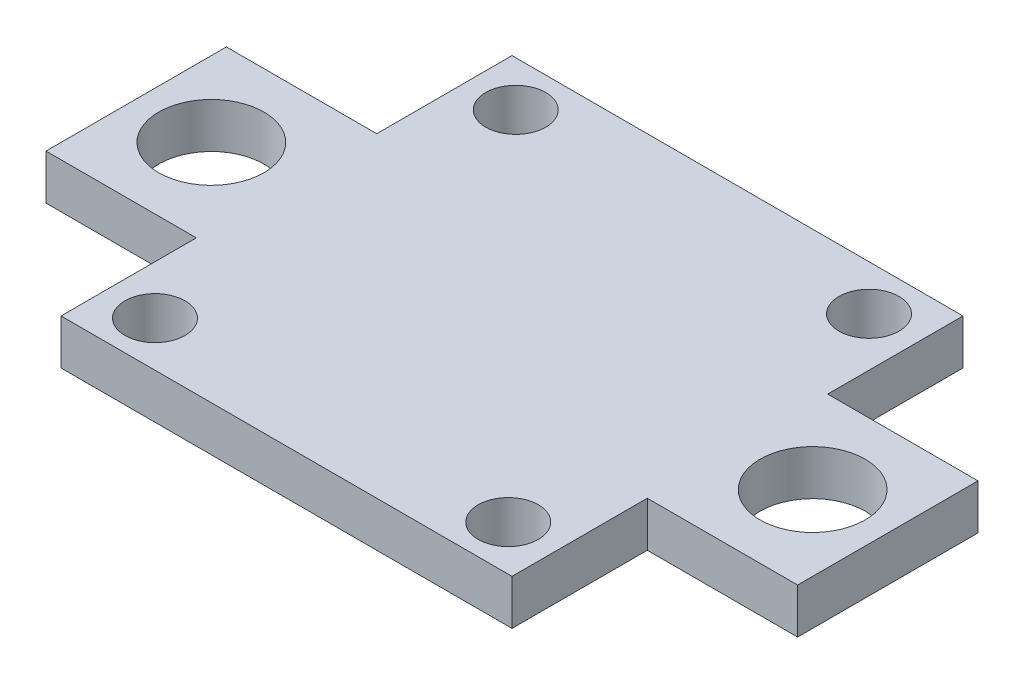
ISO-10303-21;
HEADER;
FILE_DESCRIPTION(('STEP AP214'),'2;1');
FILE_NAME('part.step','',(''),(''),'','','');
FILE_SCHEMA(('AUTOMOTIVE_DESIGN { 1 0 10303 214 1 1 1 1 }'));
ENDSEC;
DATA;
#1=APPLICATION_CONTEXT('core data for automotive mechanical design processes');
#2=APPLICATION_PROTOCOL_DEFINITION('international standard','automotive_design',2000,#1);
#3=PRODUCT_CONTEXT('',#1,'mechanical');
#4=PRODUCT('Part','Part','',(#3));
#5=PRODUCT_RELATED_PRODUCT_CATEGORY('part','',(#4));
#6=PRODUCT_DEFINITION_FORMATION('','',#4);
#7=PRODUCT_DEFINITION_CONTEXT('part definition',#1,'design');
#8=PRODUCT_DEFINITION('design','',#6,#7);
#9=PRODUCT_DEFINITION_SHAPE('','',#8);
#10=(LENGTH_UNIT() NAMED_UNIT(*) SI_UNIT(.MILLI.,.METRE.));
#11=(NAMED_UNIT(*) PLANE_ANGLE_UNIT() SI_UNIT($,.RADIAN.));
#12=(NAMED_UNIT(*) SI_UNIT($,.STERADIAN.) SOLID_ANGLE_UNIT());
#13=UNCERTAINTY_MEASURE_WITH_UNIT(LENGTH_MEASURE(1.E-05),#10,'distance_accuracy_value','');
#14=(GEOMETRIC_REPRESENTATION_CONTEXT(3) GLOBAL_UNCERTAINTY_ASSIGNED_CONTEXT((#13)) GLOBAL_UNIT_ASSIGNED_CONTEXT((#10,
#11,#12)) REPRESENTATION_CONTEXT('',''));
#15=CARTESIAN_POINT('',(0.,0.,0.));
#16=DIRECTION('',(0.,0.,1.));
#17=DIRECTION('',(1.,0.,0.));
#18=AXIS2_PLACEMENT_3D('',#15,#16,#17);
#19=CARTESIAN_POINT('',(-15.,3.,-15.));
#20=DIRECTION('',(1.,0.,0.));
#21=DIRECTION('',(0.,0.,-1.));
#22=AXIS2_PLACEMENT_3D('',#19,#20,#21);
#23=PLANE('',#22);
#24=DIRECTION('',(0.,0.,1.));
#25=VECTOR('',#24,1.);
#26=CARTESIAN_POINT('',(-15.,0.,-15.));
#27=LINE('',#26,#25);
#28=CARTESIAN_POINT('',(-15.,0.,-15.));
#29=VERTEX_POINT('',#28);
#30=CARTESIAN_POINT('',(-15.,0.,-6.));
#31=VERTEX_POINT('',#30);
#32=EDGE_CURVE('E170',#29,#31,#27,.T.);
#33=ORIENTED_EDGE('',*,*,#32,.T.);
#34=DIRECTION('',(0.,-1.,0.));
#35=VECTOR('',#34,1.);
#36=CARTESIAN_POINT('',(-15.,3.,-6.));
#37=LINE('',#36,#35);
#38=CARTESIAN_POINT('',(-15.,3.,-6.));
#39=VERTEX_POINT('',#38);
#40=EDGE_CURVE('E11',#39,#31,#37,.T.);
#41=ORIENTED_EDGE('',*,*,#40,.F.);
#42=DIRECTION('',(0.,0.,1.));
#43=VECTOR('',#42,1.);
#44=CARTESIAN_POINT('',(-15.,3.,-15.));
#45=LINE('',#44,#43);
#46=CARTESIAN_POINT('',(-15.,3.,-15.));
#47=VERTEX_POINT('',#46);
#48=EDGE_CURVE('E205',#47,#39,#45,.T.);
#49=ORIENTED_EDGE('',*,*,#48,.F.);
#50=DIRECTION('',(0.,-1.,0.));
#51=VECTOR('',#50,1.);
#52=CARTESIAN_POINT('',(-15.,3.,-15.));
#53=LINE('',#52,#51);
#54=EDGE_CURVE('E166',#47,#29,#53,.T.);
#55=ORIENTED_EDGE('',*,*,#54,.T.);
#56=EDGE_LOOP('',(#33,#41,#49,#55));
#57=FACE_BOUND('',#56,.T.);
#58=ADVANCED_FACE('F45',(#57),#23,.F.);
#59=CARTESIAN_POINT('',(-25.,3.,-6.));
#60=DIRECTION('',(0.,0.,1.));
#61=DIRECTION('',(1.,0.,0.));
#62=AXIS2_PLACEMENT_3D('',#59,#60,#61);
#63=PLANE('',#62);
#64=DIRECTION('',(-1.,0.,0.));
#65=VECTOR('',#64,1.);
#66=CARTESIAN_POINT('',(-25.,0.,-6.));
#67=LINE('',#66,#65);
#68=CARTESIAN_POINT('',(-25.,0.,-6.));
#69=VERTEX_POINT('',#68);
#70=EDGE_CURVE('E174',#31,#69,#67,.T.);
#71=ORIENTED_EDGE('',*,*,#70,.T.);
#72=DIRECTION('',(0.,-1.,0.));
#73=VECTOR('',#72,1.);
#74=CARTESIAN_POINT('',(-25.,3.,-6.));
#75=LINE('',#74,#73);
#76=CARTESIAN_POINT('',(-25.,3.,-6.));
#77=VERTEX_POINT('',#76);
#78=EDGE_CURVE('E54',#77,#69,#75,.T.);
#79=ORIENTED_EDGE('',*,*,#78,.F.);
#80=DIRECTION('',(-1.,0.,0.));
#81=VECTOR('',#80,1.);
#82=CARTESIAN_POINT('',(-25.,3.,-6.));
#83=LINE('',#82,#81);
#84=EDGE_CURVE('E117',#39,#77,#83,.T.);
#85=ORIENTED_EDGE('',*,*,#84,.F.);
#86=ORIENTED_EDGE('',*,*,#40,.T.);
#87=EDGE_LOOP('',(#71,#79,#85,#86));
#88=FACE_BOUND('',#87,.T.);
#89=ADVANCED_FACE('F300',(#88),#63,.F.);
#90=CARTESIAN_POINT('',(-25.,3.,-6.));
#91=DIRECTION('',(1.,0.,0.));
#92=DIRECTION('',(0.,0.,-1.));
#93=AXIS2_PLACEMENT_3D('',#90,#91,#92);
#94=PLANE('',#93);
#95=DIRECTION('',(0.,0.,1.));
#96=VECTOR('',#95,1.);
#97=CARTESIAN_POINT('',(-25.,0.,-6.));
#98=LINE('',#97,#96);
#99=CARTESIAN_POINT('',(-25.,0.,6.));
#100=VERTEX_POINT('',#99);
#101=EDGE_CURVE('E178',#69,#100,#98,.T.);
#102=ORIENTED_EDGE('',*,*,#101,.T.);
#103=DIRECTION('',(0.,-1.,0.));
#104=VECTOR('',#103,1.);
#105=CARTESIAN_POINT('',(-25.,3.,6.));
#106=LINE('',#105,#104);
#107=CARTESIAN_POINT('',(-25.,3.,6.));
#108=VERTEX_POINT('',#107);
#109=EDGE_CURVE('E232',#108,#100,#106,.T.);
#110=ORIENTED_EDGE('',*,*,#109,.F.);
#111=DIRECTION('',(0.,0.,1.));
#112=VECTOR('',#111,1.);
#113=CARTESIAN_POINT('',(-25.,3.,-6.));
#114=LINE('',#113,#112);
#115=EDGE_CURVE('E242',#77,#108,#114,.T.);
#116=ORIENTED_EDGE('',*,*,#115,.F.);
#117=ORIENTED_EDGE('',*,*,#78,.T.);
#118=EDGE_LOOP('',(#102,#110,#116,#117));
#119=FACE_BOUND('',#118,.T.);
#120=ADVANCED_FACE('F240',(#119),#94,.F.);
#121=CARTESIAN_POINT('',(-25.,3.,6.));
#122=DIRECTION('',(0.,0.,-1.));
#123=DIRECTION('',(-1.,0.,0.));
#124=AXIS2_PLACEMENT_3D('',#121,#122,#123);
#125=PLANE('',#124);
#126=DIRECTION('',(1.,0.,0.));
#127=VECTOR('',#126,1.);
#128=CARTESIAN_POINT('',(-25.,0.,6.));
#129=LINE('',#128,#127);
#130=CARTESIAN_POINT('',(-15.,0.,6.));
#131=VERTEX_POINT('',#130);
#132=EDGE_CURVE('E181',#100,#131,#129,.T.);
#133=ORIENTED_EDGE('',*,*,#132,.T.);
#134=DIRECTION('',(0.,-1.,0.));
#135=VECTOR('',#134,1.);
#136=CARTESIAN_POINT('',(-15.,3.,6.));
#137=LINE('',#136,#135);
#138=CARTESIAN_POINT('',(-15.,3.,6.));
#139=VERTEX_POINT('',#138);
#140=EDGE_CURVE('E228',#139,#131,#137,.T.);
#141=ORIENTED_EDGE('',*,*,#140,.F.);
#142=DIRECTION('',(1.,0.,0.));
#143=VECTOR('',#142,1.);
#144=CARTESIAN_POINT('',(-25.,3.,6.));
#145=LINE('',#144,#143);
#146=EDGE_CURVE('E261',#108,#139,#145,.T.);
#147=ORIENTED_EDGE('',*,*,#146,.F.);
#148=ORIENTED_EDGE('',*,*,#109,.T.);
#149=EDGE_LOOP('',(#133,#141,#147,#148));
#150=FACE_BOUND('',#149,.T.);
#151=ADVANCED_FACE('F251',(#150),#125,.F.);
#152=CARTESIAN_POINT('',(-15.,3.,6.));
#153=DIRECTION('',(1.,0.,0.));
#154=DIRECTION('',(0.,0.,-1.));
#155=AXIS2_PLACEMENT_3D('',#152,#153,#154);
#156=PLANE('',#155);
#157=DIRECTION('',(0.,0.,1.));
#158=VECTOR('',#157,1.);
#159=CARTESIAN_POINT('',(-15.,0.,6.));
#160=LINE('',#159,#158);
#161=CARTESIAN_POINT('',(-15.,0.,15.));
#162=VERTEX_POINT('',#161);
#163=EDGE_CURVE('E184',#131,#162,#160,.T.);
#164=ORIENTED_EDGE('',*,*,#163,.T.);
#165=DIRECTION('',(0.,-1.,0.));
#166=VECTOR('',#165,1.);
#167=CARTESIAN_POINT('',(-15.,3.,15.));
#168=LINE('',#167,#166);
#169=CARTESIAN_POINT('',(-15.,3.,15.));
#170=VERTEX_POINT('',#169);
#171=EDGE_CURVE('E224',#170,#162,#168,.T.);
#172=ORIENTED_EDGE('',*,*,#171,.F.);
#173=DIRECTION('',(0.,0.,1.));
#174=VECTOR('',#173,1.);
#175=CARTESIAN_POINT('',(-15.,3.,6.));
#176=LINE('',#175,#174);
#177=EDGE_CURVE('E257',#139,#170,#176,.T.);
#178=ORIENTED_EDGE('',*,*,#177,.F.);
#179=ORIENTED_EDGE('',*,*,#140,.T.);
#180=EDGE_LOOP('',(#164,#172,#178,#179));
#181=FACE_BOUND('',#180,.T.);
#182=ADVANCED_FACE('F255',(#181),#156,.F.);
#183=CARTESIAN_POINT('',(-15.,3.,15.));
#184=DIRECTION('',(0.,0.,-1.));
#185=DIRECTION('',(-1.,0.,0.));
#186=AXIS2_PLACEMENT_3D('',#183,#184,#185);
#187=PLANE('',#186);
#188=DIRECTION('',(1.,0.,0.));
#189=VECTOR('',#188,1.);
#190=CARTESIAN_POINT('',(-15.,0.,15.));
#191=LINE('',#190,#189);
#192=CARTESIAN_POINT('',(15.,0.,15.));
#193=VERTEX_POINT('',#192);
#194=EDGE_CURVE('E187',#162,#193,#191,.T.);
#195=ORIENTED_EDGE('',*,*,#194,.T.);
#196=DIRECTION('',(0.,-1.,0.));
#197=VECTOR('',#196,1.);
#198=CARTESIAN_POINT('',(15.,3.,15.));
#199=LINE('',#198,#197);
#200=CARTESIAN_POINT('',(15.,3.,15.));
#201=VERTEX_POINT('',#200);
#202=EDGE_CURVE('E220',#201,#193,#199,.T.);
#203=ORIENTED_EDGE('',*,*,#202,.F.);
#204=DIRECTION('',(1.,0.,0.));
#205=VECTOR('',#204,1.);
#206=CARTESIAN_POINT('',(-15.,3.,15.));
#207=LINE('',#206,#205);
#208=EDGE_CURVE('E260',#170,#201,#207,.T.);
#209=ORIENTED_EDGE('',*,*,#208,.F.);
#210=ORIENTED_EDGE('',*,*,#171,.T.);
#211=EDGE_LOOP('',(#195,#203,#209,#210));
#212=FACE_BOUND('',#211,.T.);
#213=ADVANCED_FACE('F313',(#212),#187,.F.);
#214=CARTESIAN_POINT('',(15.,3.,6.));
#215=DIRECTION('',(-1.,0.,0.));
#216=DIRECTION('',(0.,0.,1.));
#217=AXIS2_PLACEMENT_3D('',#214,#215,#216);
#218=PLANE('',#217);
#219=DIRECTION('',(0.,0.,-1.));
#220=VECTOR('',#219,1.);
#221=CARTESIAN_POINT('',(15.,0.,6.));
#222=LINE('',#221,#220);
#223=CARTESIAN_POINT('',(15.,0.,6.));
#224=VERTEX_POINT('',#223);
#225=EDGE_CURVE('E190',#193,#224,#222,.T.);
#226=ORIENTED_EDGE('',*,*,#225,.T.);
#227=DIRECTION('',(0.,-1.,0.));
#228=VECTOR('',#227,1.);
#229=CARTESIAN_POINT('',(15.,3.,6.));
#230=LINE('',#229,#228);
#231=CARTESIAN_POINT('',(15.,3.,6.));
#232=VERTEX_POINT('',#231);
#233=EDGE_CURVE('E216',#232,#224,#230,.T.);
#234=ORIENTED_EDGE('',*,*,#233,.F.);
#235=DIRECTION('',(0.,0.,-1.));
#236=VECTOR('',#235,1.);
#237=CARTESIAN_POINT('',(15.,3.,6.));
#238=LINE('',#237,#236);
#239=EDGE_CURVE('E265',#201,#232,#238,.T.);
#240=ORIENTED_EDGE('',*,*,#239,.F.);
#241=ORIENTED_EDGE('',*,*,#202,.T.);
#242=EDGE_LOOP('',(#226,#234,#240,#241));
#243=FACE_BOUND('',#242,.T.);
#244=ADVANCED_FACE('F316',(#243),#218,.F.);
#245=CARTESIAN_POINT('',(15.,3.,6.));
#246=DIRECTION('',(0.,0.,-1.));
#247=DIRECTION('',(-1.,0.,0.));
#248=AXIS2_PLACEMENT_3D('',#245,#246,#247);
#249=PLANE('',#248);
#250=DIRECTION('',(1.,0.,0.));
#251=VECTOR('',#250,1.);
#252=CARTESIAN_POINT('',(15.,0.,6.));
#253=LINE('',#252,#251);
#254=CARTESIAN_POINT('',(25.,0.,6.));
#255=VERTEX_POINT('',#254);
#256=EDGE_CURVE('E193',#224,#255,#253,.T.);
#257=ORIENTED_EDGE('',*,*,#256,.T.);
#258=DIRECTION('',(0.,-1.,0.));
#259=VECTOR('',#258,1.);
#260=CARTESIAN_POINT('',(25.,3.,6.));
#261=LINE('',#260,#259);
#262=CARTESIAN_POINT('',(25.,3.,6.));
#263=VERTEX_POINT('',#262);
#264=EDGE_CURVE('E212',#263,#255,#261,.T.);
#265=ORIENTED_EDGE('',*,*,#264,.F.);
#266=DIRECTION('',(1.,0.,0.));
#267=VECTOR('',#266,1.);
#268=CARTESIAN_POINT('',(15.,3.,6.));
#269=LINE('',#268,#267);
#270=EDGE_CURVE('E272',#232,#263,#269,.T.);
#271=ORIENTED_EDGE('',*,*,#270,.F.);
#272=ORIENTED_EDGE('',*,*,#233,.T.);
#273=EDGE_LOOP('',(#257,#265,#271,#272));
#274=FACE_BOUND('',#273,.T.);
#275=ADVANCED_FACE('F280',(#274),#249,.F.);
#276=CARTESIAN_POINT('',(25.,3.,-6.));
#277=DIRECTION('',(-1.,0.,0.));
#278=DIRECTION('',(0.,0.,1.));
#279=AXIS2_PLACEMENT_3D('',#276,#277,#278);
#280=PLANE('',#279);
#281=DIRECTION('',(0.,0.,-1.));
#282=VECTOR('',#281,1.);
#283=CARTESIAN_POINT('',(25.,0.,-6.));
#284=LINE('',#283,#282);
#285=CARTESIAN_POINT('',(25.,0.,-6.));
#286=VERTEX_POINT('',#285);
#287=EDGE_CURVE('E196',#255,#286,#284,.T.);
#288=ORIENTED_EDGE('',*,*,#287,.T.);
#289=DIRECTION('',(0.,-1.,0.));
#290=VECTOR('',#289,1.);
#291=CARTESIAN_POINT('',(25.,3.,-6.));
#292=LINE('',#291,#290);
#293=CARTESIAN_POINT('',(25.,3.,-6.));
#294=VERTEX_POINT('',#293);
#295=EDGE_CURVE('E159',#294,#286,#292,.T.);
#296=ORIENTED_EDGE('',*,*,#295,.F.);
#297=DIRECTION('',(0.,0.,-1.));
#298=VECTOR('',#297,1.);
#299=CARTESIAN_POINT('',(25.,3.,-6.));
#300=LINE('',#299,#298);
#301=EDGE_CURVE('E148',#263,#294,#300,.T.);
#302=ORIENTED_EDGE('',*,*,#301,.F.);
#303=ORIENTED_EDGE('',*,*,#264,.T.);
#304=EDGE_LOOP('',(#288,#296,#302,#303));
#305=FACE_BOUND('',#304,.T.);
#306=ADVANCED_FACE('F284',(#305),#280,.F.);
#307=CARTESIAN_POINT('',(15.,3.,-6.));
#308=DIRECTION('',(0.,0.,1.));
#309=DIRECTION('',(1.,0.,0.));
#310=AXIS2_PLACEMENT_3D('',#307,#308,#309);
#311=PLANE('',#310);
#312=DIRECTION('',(-1.,0.,0.));
#313=VECTOR('',#312,1.);
#314=CARTESIAN_POINT('',(15.,0.,-6.));
#315=LINE('',#314,#313);
#316=CARTESIAN_POINT('',(15.,0.,-6.));
#317=VERTEX_POINT('',#316);
#318=EDGE_CURVE('E157',#286,#317,#315,.T.);
#319=ORIENTED_EDGE('',*,*,#318,.T.);
#320=DIRECTION('',(0.,-1.,0.));
#321=VECTOR('',#320,1.);
#322=CARTESIAN_POINT('',(15.,3.,-6.));
#323=LINE('',#322,#321);
#324=CARTESIAN_POINT('',(15.,3.,-6.));
#325=VERTEX_POINT('',#324);
#326=EDGE_CURVE('E154',#325,#317,#323,.T.);
#327=ORIENTED_EDGE('',*,*,#326,.F.);
#328=DIRECTION('',(-1.,0.,0.));
#329=VECTOR('',#328,1.);
#330=CARTESIAN_POINT('',(15.,3.,-6.));
#331=LINE('',#330,#329);
#332=EDGE_CURVE('E142',#294,#325,#331,.T.);
#333=ORIENTED_EDGE('',*,*,#332,.F.);
#334=ORIENTED_EDGE('',*,*,#295,.T.);
#335=EDGE_LOOP('',(#319,#327,#333,#334));
#336=FACE_BOUND('',#335,.T.);
#337=ADVANCED_FACE('F155',(#336),#311,.F.);
#338=CARTESIAN_POINT('',(15.,3.,-15.));
#339=DIRECTION('',(-1.,0.,0.));
#340=DIRECTION('',(0.,0.,1.));
#341=AXIS2_PLACEMENT_3D('',#338,#339,#340);
#342=PLANE('',#341);
#343=DIRECTION('',(0.,0.,-1.));
#344=VECTOR('',#343,1.);
#345=CARTESIAN_POINT('',(15.,0.,-15.));
#346=LINE('',#345,#344);
#347=CARTESIAN_POINT('',(15.,0.,-15.));
#348=VERTEX_POINT('',#347);
#349=EDGE_CURVE('E103',#317,#348,#346,.T.);
#350=ORIENTED_EDGE('',*,*,#349,.T.);
#351=DIRECTION('',(0.,-1.,0.));
#352=VECTOR('',#351,1.);
#353=CARTESIAN_POINT('',(15.,3.,-15.));
#354=LINE('',#353,#352);
#355=CARTESIAN_POINT('',(15.,3.,-15.));
#356=VERTEX_POINT('',#355);
#357=EDGE_CURVE('E160',#356,#348,#354,.T.);
#358=ORIENTED_EDGE('',*,*,#357,.F.);
#359=DIRECTION('',(0.,0.,-1.));
#360=VECTOR('',#359,1.);
#361=CARTESIAN_POINT('',(15.,3.,-15.));
#362=LINE('',#361,#360);
#363=EDGE_CURVE('E146',#325,#356,#362,.T.);
#364=ORIENTED_EDGE('',*,*,#363,.F.);
#365=ORIENTED_EDGE('',*,*,#326,.T.);
#366=EDGE_LOOP('',(#350,#358,#364,#365));
#367=FACE_BOUND('',#366,.T.);
#368=ADVANCED_FACE('F162',(#367),#342,.F.);
#369=CARTESIAN_POINT('',(-15.,3.,-15.));
#370=DIRECTION('',(0.,0.,1.));
#371=DIRECTION('',(1.,0.,0.));
#372=AXIS2_PLACEMENT_3D('',#369,#370,#371);
#373=PLANE('',#372);
#374=DIRECTION('',(-1.,0.,0.));
#375=VECTOR('',#374,1.);
#376=CARTESIAN_POINT('',(-15.,0.,-15.));
#377=LINE('',#376,#375);
#378=EDGE_CURVE('E109',#348,#29,#377,.T.);
#379=ORIENTED_EDGE('',*,*,#378,.T.);
#380=ORIENTED_EDGE('',*,*,#54,.F.);
#381=DIRECTION('',(-1.,0.,0.));
#382=VECTOR('',#381,1.);
#383=CARTESIAN_POINT('',(-15.,3.,-15.));
#384=LINE('',#383,#382);
#385=EDGE_CURVE('E62',#356,#47,#384,.T.);
#386=ORIENTED_EDGE('',*,*,#385,.F.);
#387=ORIENTED_EDGE('',*,*,#357,.T.);
#388=EDGE_LOOP('',(#379,#380,#386,#387));
#389=FACE_BOUND('',#388,.T.);
#390=ADVANCED_FACE('F288',(#389),#373,.F.);
#391=CARTESIAN_POINT('',(0.,3.,0.));
#392=DIRECTION('',(0.,1.,0.));
#393=DIRECTION('',(0.,0.,1.));
#394=AXIS2_PLACEMENT_3D('',#391,#392,#393);
#395=PLANE('',#394);
#396=CARTESIAN_POINT('',(-20.,3.,0.));
#397=DIRECTION('',(0.,1.,0.));
#398=DIRECTION('',(0.,0.,1.));
#399=AXIS2_PLACEMENT_3D('',#396,#397,#398);
#400=CIRCLE('',#399,3.5);
#401=CARTESIAN_POINT('',(-20.,3.,3.5));
#402=VERTEX_POINT('',#401);
#403=EDGE_CURVE('E422',#402,#402,#400,.T.);
#404=ORIENTED_EDGE('',*,*,#403,.F.);
#405=EDGE_LOOP('',(#404));
#406=FACE_BOUND('',#405,.T.);
#407=CARTESIAN_POINT('',(11.75,3.,-12.));
#408=DIRECTION('',(0.,1.,0.));
#409=DIRECTION('',(0.,0.,-1.));
#410=AXIS2_PLACEMENT_3D('',#407,#408,#409);
#411=CIRCLE('',#410,2.);
#412=CARTESIAN_POINT('',(11.75,3.,-14.));
#413=VERTEX_POINT('',#412);
#414=EDGE_CURVE('E433',#413,#413,#411,.T.);
#415=ORIENTED_EDGE('',*,*,#414,.F.);
#416=EDGE_LOOP('',(#415));
#417=FACE_BOUND('',#416,.T.);
#418=CARTESIAN_POINT('',(20.,3.,0.));
#419=DIRECTION('',(0.,1.,0.));
#420=DIRECTION('',(0.,0.,-1.));
#421=AXIS2_PLACEMENT_3D('',#418,#419,#420);
#422=CIRCLE('',#421,3.5);
#423=CARTESIAN_POINT('',(20.,3.,-3.5));
#424=VERTEX_POINT('',#423);
#425=EDGE_CURVE('E461',#424,#424,#422,.T.);
#426=ORIENTED_EDGE('',*,*,#425,.F.);
#427=EDGE_LOOP('',(#426));
#428=FACE_BOUND('',#427,.T.);
#429=CARTESIAN_POINT('',(11.75,3.,12.));
#430=DIRECTION('',(0.,1.,0.));
#431=DIRECTION('',(0.,0.,-1.));
#432=AXIS2_PLACEMENT_3D('',#429,#430,#431);
#433=CIRCLE('',#432,2.);
#434=CARTESIAN_POINT('',(11.75,3.,10.));
#435=VERTEX_POINT('',#434);
#436=EDGE_CURVE('E453',#435,#435,#433,.T.);
#437=ORIENTED_EDGE('',*,*,#436,.F.);
#438=EDGE_LOOP('',(#437));
#439=FACE_BOUND('',#438,.T.);
#440=CARTESIAN_POINT('',(-11.75,3.,12.));
#441=DIRECTION('',(0.,1.,0.));
#442=DIRECTION('',(0.,0.,1.));
#443=AXIS2_PLACEMENT_3D('',#440,#441,#442);
#444=CIRCLE('',#443,2.);
#445=CARTESIAN_POINT('',(-11.75,3.,14.));
#446=VERTEX_POINT('',#445);
#447=EDGE_CURVE('E445',#446,#446,#444,.T.);
#448=ORIENTED_EDGE('',*,*,#447,.F.);
#449=EDGE_LOOP('',(#448));
#450=FACE_BOUND('',#449,.T.);
#451=CARTESIAN_POINT('',(-11.75,3.,-12.));
#452=DIRECTION('',(0.,1.,0.));
#453=DIRECTION('',(0.,0.,1.));
#454=AXIS2_PLACEMENT_3D('',#451,#452,#453);
#455=CIRCLE('',#454,2.);
#456=CARTESIAN_POINT('',(-11.75,3.,-10.));
#457=VERTEX_POINT('',#456);
#458=EDGE_CURVE('E424',#457,#457,#455,.T.);
#459=ORIENTED_EDGE('',*,*,#458,.F.);
#460=EDGE_LOOP('',(#459));
#461=FACE_BOUND('',#460,.T.);
#462=ORIENTED_EDGE('',*,*,#48,.T.);
#463=ORIENTED_EDGE('',*,*,#84,.T.);
#464=ORIENTED_EDGE('',*,*,#115,.T.);
#465=ORIENTED_EDGE('',*,*,#146,.T.);
#466=ORIENTED_EDGE('',*,*,#177,.T.);
#467=ORIENTED_EDGE('',*,*,#208,.T.);
#468=ORIENTED_EDGE('',*,*,#239,.T.);
#469=ORIENTED_EDGE('',*,*,#270,.T.);
#470=ORIENTED_EDGE('',*,*,#301,.T.);
#471=ORIENTED_EDGE('',*,*,#332,.T.);
#472=ORIENTED_EDGE('',*,*,#363,.T.);
#473=ORIENTED_EDGE('',*,*,#385,.T.);
#474=EDGE_LOOP('',(#462,#463,#464,#465,#466,#467,#468,#469,#470,#471,#472,#473));
#475=FACE_BOUND('',#474,.T.);
#476=ADVANCED_FACE('F144',(#406,#417,#428,#439,#450,#461,#475),#395,.T.);
#477=CARTESIAN_POINT('',(0.,0.,0.));
#478=DIRECTION('',(0.,1.,0.));
#479=DIRECTION('',(0.,0.,1.));
#480=AXIS2_PLACEMENT_3D('',#477,#478,#479);
#481=PLANE('',#480);
#482=CARTESIAN_POINT('',(-20.,0.,0.));
#483=DIRECTION('',(0.,1.,0.));
#484=DIRECTION('',(0.,0.,1.));
#485=AXIS2_PLACEMENT_3D('',#482,#483,#484);
#486=CIRCLE('',#485,3.5);
#487=CARTESIAN_POINT('',(-20.,0.,3.5));
#488=VERTEX_POINT('',#487);
#489=EDGE_CURVE('E175',#488,#488,#486,.T.);
#490=ORIENTED_EDGE('',*,*,#489,.T.);
#491=EDGE_LOOP('',(#490));
#492=FACE_BOUND('',#491,.T.);
#493=CARTESIAN_POINT('',(11.75,0.,-12.));
#494=DIRECTION('',(0.,1.,0.));
#495=DIRECTION('',(0.,0.,-1.));
#496=AXIS2_PLACEMENT_3D('',#493,#494,#495);
#497=CIRCLE('',#496,2.);
#498=CARTESIAN_POINT('',(11.75,0.,-14.));
#499=VERTEX_POINT('',#498);
#500=EDGE_CURVE('E438',#499,#499,#497,.T.);
#501=ORIENTED_EDGE('',*,*,#500,.T.);
#502=EDGE_LOOP('',(#501));
#503=FACE_BOUND('',#502,.T.);
#504=CARTESIAN_POINT('',(20.,0.,0.));
#505=DIRECTION('',(0.,1.,0.));
#506=DIRECTION('',(0.,0.,-1.));
#507=AXIS2_PLACEMENT_3D('',#504,#505,#506);
#508=CIRCLE('',#507,3.5);
#509=CARTESIAN_POINT('',(20.,0.,-3.5));
#510=VERTEX_POINT('',#509);
#511=EDGE_CURVE('E437',#510,#510,#508,.T.);
#512=ORIENTED_EDGE('',*,*,#511,.T.);
#513=EDGE_LOOP('',(#512));
#514=FACE_BOUND('',#513,.T.);
#515=CARTESIAN_POINT('',(11.75,0.,12.));
#516=DIRECTION('',(0.,1.,0.));
#517=DIRECTION('',(0.,0.,-1.));
#518=AXIS2_PLACEMENT_3D('',#515,#516,#517);
#519=CIRCLE('',#518,2.);
#520=CARTESIAN_POINT('',(11.75,0.,10.));
#521=VERTEX_POINT('',#520);
#522=EDGE_CURVE('E457',#521,#521,#519,.T.);
#523=ORIENTED_EDGE('',*,*,#522,.T.);
#524=EDGE_LOOP('',(#523));
#525=FACE_BOUND('',#524,.T.);
#526=CARTESIAN_POINT('',(-11.75,0.,12.));
#527=DIRECTION('',(0.,1.,0.));
#528=DIRECTION('',(0.,0.,1.));
#529=AXIS2_PLACEMENT_3D('',#526,#527,#528);
#530=CIRCLE('',#529,2.);
#531=CARTESIAN_POINT('',(-11.75,0.,14.));
#532=VERTEX_POINT('',#531);
#533=EDGE_CURVE('E449',#532,#532,#530,.T.);
#534=ORIENTED_EDGE('',*,*,#533,.T.);
#535=EDGE_LOOP('',(#534));
#536=FACE_BOUND('',#535,.T.);
#537=CARTESIAN_POINT('',(-11.75,0.,-12.));
#538=DIRECTION('',(0.,1.,0.));
#539=DIRECTION('',(0.,0.,1.));
#540=AXIS2_PLACEMENT_3D('',#537,#538,#539);
#541=CIRCLE('',#540,2.);
#542=CARTESIAN_POINT('',(-11.75,0.,-10.));
#543=VERTEX_POINT('',#542);
#544=EDGE_CURVE('E430',#543,#543,#541,.T.);
#545=ORIENTED_EDGE('',*,*,#544,.T.);
#546=EDGE_LOOP('',(#545));
#547=FACE_BOUND('',#546,.T.);
#548=ORIENTED_EDGE('',*,*,#32,.F.);
#549=ORIENTED_EDGE('',*,*,#378,.F.);
#550=ORIENTED_EDGE('',*,*,#349,.F.);
#551=ORIENTED_EDGE('',*,*,#318,.F.);
#552=ORIENTED_EDGE('',*,*,#287,.F.);
#553=ORIENTED_EDGE('',*,*,#256,.F.);
#554=ORIENTED_EDGE('',*,*,#225,.F.);
#555=ORIENTED_EDGE('',*,*,#194,.F.);
#556=ORIENTED_EDGE('',*,*,#163,.F.);
#557=ORIENTED_EDGE('',*,*,#132,.F.);
#558=ORIENTED_EDGE('',*,*,#101,.F.);
#559=ORIENTED_EDGE('',*,*,#70,.F.);
#560=EDGE_LOOP('',(#548,#549,#550,#551,#552,#553,#554,#555,#556,#557,#558,#559));
#561=FACE_BOUND('',#560,.T.);
#562=ADVANCED_FACE('F246',(#492,#503,#514,#525,#536,#547,#561),#481,.F.);
#563=CARTESIAN_POINT('',(-11.75,0.,-12.));
#564=DIRECTION('',(0.,1.,0.));
#565=DIRECTION('',(0.,0.,1.));
#566=AXIS2_PLACEMENT_3D('',#563,#564,#565);
#567=CYLINDRICAL_SURFACE('',#566,2.);
#568=ORIENTED_EDGE('',*,*,#544,.F.);
#569=EDGE_LOOP('',(#568));
#570=FACE_BOUND('',#569,.T.);
#571=ORIENTED_EDGE('',*,*,#458,.T.);
#572=EDGE_LOOP('',(#571));
#573=FACE_BOUND('',#572,.T.);
#574=ADVANCED_FACE('F355',(#570,#573),#567,.F.);
#575=CARTESIAN_POINT('',(-11.75,0.,12.));
#576=DIRECTION('',(0.,1.,0.));
#577=DIRECTION('',(0.,0.,1.));
#578=AXIS2_PLACEMENT_3D('',#575,#576,#577);
#579=CYLINDRICAL_SURFACE('',#578,2.);
#580=ORIENTED_EDGE('',*,*,#533,.F.);
#581=EDGE_LOOP('',(#580));
#582=FACE_BOUND('',#581,.T.);
#583=ORIENTED_EDGE('',*,*,#447,.T.);
#584=EDGE_LOOP('',(#583));
#585=FACE_BOUND('',#584,.T.);
#586=ADVANCED_FACE('F364',(#582,#585),#579,.F.);
#587=CARTESIAN_POINT('',(11.75,0.,12.));
#588=DIRECTION('',(0.,1.,0.));
#589=DIRECTION('',(0.,0.,1.));
#590=AXIS2_PLACEMENT_3D('',#587,#588,#589);
#591=CYLINDRICAL_SURFACE('',#590,2.);
#592=ORIENTED_EDGE('',*,*,#522,.F.);
#593=EDGE_LOOP('',(#592));
#594=FACE_BOUND('',#593,.T.);
#595=ORIENTED_EDGE('',*,*,#436,.T.);
#596=EDGE_LOOP('',(#595));
#597=FACE_BOUND('',#596,.T.);
#598=ADVANCED_FACE('F374',(#594,#597),#591,.F.);
#599=CARTESIAN_POINT('',(20.,0.,0.));
#600=DIRECTION('',(0.,1.,0.));
#601=DIRECTION('',(0.,0.,1.));
#602=AXIS2_PLACEMENT_3D('',#599,#600,#601);
#603=CYLINDRICAL_SURFACE('',#602,3.5);
#604=ORIENTED_EDGE('',*,*,#511,.F.);
#605=EDGE_LOOP('',(#604));
#606=FACE_BOUND('',#605,.T.);
#607=ORIENTED_EDGE('',*,*,#425,.T.);
#608=EDGE_LOOP('',(#607));
#609=FACE_BOUND('',#608,.T.);
#610=ADVANCED_FACE('F384',(#606,#609),#603,.F.);
#611=CARTESIAN_POINT('',(11.75,0.,-12.));
#612=DIRECTION('',(0.,1.,0.));
#613=DIRECTION('',(0.,0.,1.));
#614=AXIS2_PLACEMENT_3D('',#611,#612,#613);
#615=CYLINDRICAL_SURFACE('',#614,2.);
#616=ORIENTED_EDGE('',*,*,#500,.F.);
#617=EDGE_LOOP('',(#616));
#618=FACE_BOUND('',#617,.T.);
#619=ORIENTED_EDGE('',*,*,#414,.T.);
#620=EDGE_LOOP('',(#619));
#621=FACE_BOUND('',#620,.T.);
#622=ADVANCED_FACE('F394',(#618,#621),#615,.F.);
#623=CARTESIAN_POINT('',(-20.,0.,0.));
#624=DIRECTION('',(0.,1.,0.));
#625=DIRECTION('',(0.,0.,1.));
#626=AXIS2_PLACEMENT_3D('',#623,#624,#625);
#627=CYLINDRICAL_SURFACE('',#626,3.5);
#628=ORIENTED_EDGE('',*,*,#489,.F.);
#629=EDGE_LOOP('',(#628));
#630=FACE_BOUND('',#629,.T.);
#631=ORIENTED_EDGE('',*,*,#403,.T.);
#632=EDGE_LOOP('',(#631));
#633=FACE_BOUND('',#632,.T.);
#634=ADVANCED_FACE('F404',(#630,#633),#627,.F.);
#635=CLOSED_SHELL('',(#58,#89,#120,#151,#182,#213,#244,#275,#306,#337,#368,#390,#476,#562,#574,
#586,#598,#610,#622,#634));
#636=MANIFOLD_SOLID_BREP('B2',#635);
#637=ADVANCED_BREP_SHAPE_REPRESENTATION('',(#18,#636),#14);
#638=SHAPE_DEFINITION_REPRESENTATION(#9,#637);
ENDSEC;
END-ISO-10303-21;
